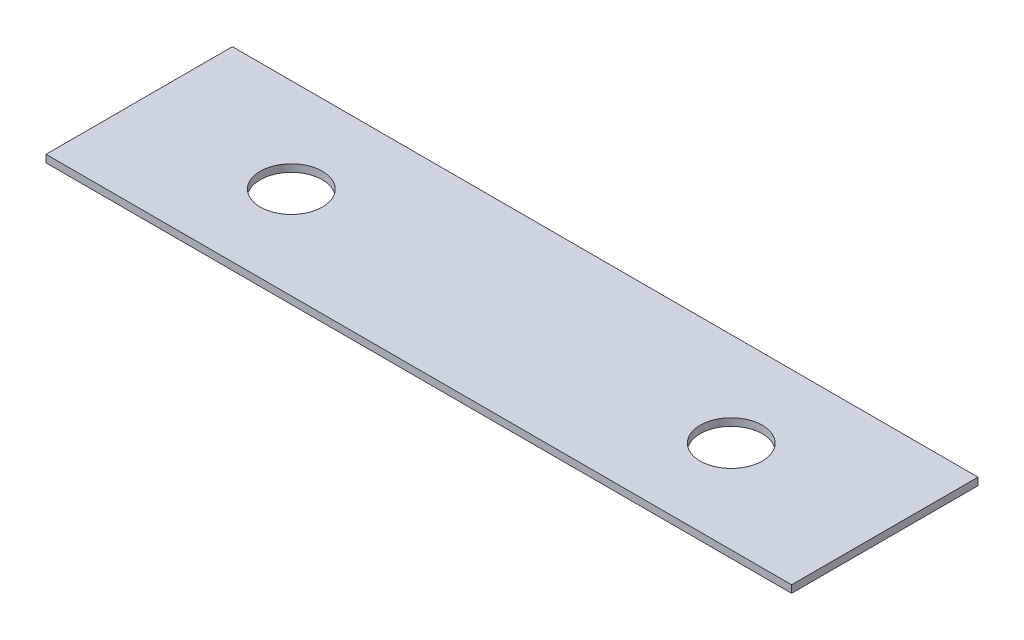
ISO-10303-21;
HEADER;
FILE_DESCRIPTION(('STEP AP214'),'2;1');
FILE_NAME('part.step','',(''),(''),'','','');
FILE_SCHEMA(('AUTOMOTIVE_DESIGN { 1 0 10303 214 1 1 1 1 }'));
ENDSEC;
DATA;
#1=APPLICATION_CONTEXT('core data for automotive mechanical design processes');
#2=APPLICATION_PROTOCOL_DEFINITION('international standard','automotive_design',2000,#1);
#3=PRODUCT_CONTEXT('',#1,'mechanical');
#4=PRODUCT('Part','Part','',(#3));
#5=PRODUCT_RELATED_PRODUCT_CATEGORY('part','',(#4));
#6=PRODUCT_DEFINITION_FORMATION('','',#4);
#7=PRODUCT_DEFINITION_CONTEXT('part definition',#1,'design');
#8=PRODUCT_DEFINITION('design','',#6,#7);
#9=PRODUCT_DEFINITION_SHAPE('','',#8);
#10=(LENGTH_UNIT() NAMED_UNIT(*) SI_UNIT(.MILLI.,.METRE.));
#11=(NAMED_UNIT(*) PLANE_ANGLE_UNIT() SI_UNIT($,.RADIAN.));
#12=(NAMED_UNIT(*) SI_UNIT($,.STERADIAN.) SOLID_ANGLE_UNIT());
#13=UNCERTAINTY_MEASURE_WITH_UNIT(LENGTH_MEASURE(1.E-05),#10,'distance_accuracy_value','');
#14=(GEOMETRIC_REPRESENTATION_CONTEXT(3) GLOBAL_UNCERTAINTY_ASSIGNED_CONTEXT((#13)) GLOBAL_UNIT_ASSIGNED_CONTEXT((#10,
#11,#12)) REPRESENTATION_CONTEXT('',''));
#15=CARTESIAN_POINT('',(0.,0.,0.));
#16=DIRECTION('',(0.,0.,1.));
#17=DIRECTION('',(1.,0.,0.));
#18=AXIS2_PLACEMENT_3D('',#15,#16,#17);
#19=CARTESIAN_POINT('',(152.4,0.,0.));
#20=DIRECTION('',(0.,0.,-1.));
#21=DIRECTION('',(-1.,0.,0.));
#22=AXIS2_PLACEMENT_3D('',#19,#20,#21);
#23=PLANE('',#22);
#24=DIRECTION('',(0.,-1.,0.));
#25=VECTOR('',#24,1.);
#26=CARTESIAN_POINT('',(0.,0.,0.));
#27=LINE('',#26,#25);
#28=CARTESIAN_POINT('',(0.,1.51892,0.));
#29=VERTEX_POINT('',#28);
#30=CARTESIAN_POINT('',(0.,0.,0.));
#31=VERTEX_POINT('',#30);
#32=EDGE_CURVE('E97',#29,#31,#27,.T.);
#33=ORIENTED_EDGE('',*,*,#32,.T.);
#34=DIRECTION('',(-1.,0.,0.));
#35=VECTOR('',#34,1.);
#36=CARTESIAN_POINT('',(152.4,0.,0.));
#37=LINE('',#36,#35);
#38=CARTESIAN_POINT('',(152.4,0.,0.));
#39=VERTEX_POINT('',#38);
#40=EDGE_CURVE('E11',#39,#31,#37,.T.);
#41=ORIENTED_EDGE('',*,*,#40,.F.);
#42=DIRECTION('',(0.,-1.,0.));
#43=VECTOR('',#42,1.);
#44=CARTESIAN_POINT('',(152.4,0.,0.));
#45=LINE('',#44,#43);
#46=CARTESIAN_POINT('',(152.4,1.51892,0.));
#47=VERTEX_POINT('',#46);
#48=EDGE_CURVE('E85',#47,#39,#45,.T.);
#49=ORIENTED_EDGE('',*,*,#48,.F.);
#50=DIRECTION('',(-1.,0.,0.));
#51=VECTOR('',#50,1.);
#52=CARTESIAN_POINT('',(152.4,1.51892,0.));
#53=LINE('',#52,#51);
#54=EDGE_CURVE('E93',#47,#29,#53,.T.);
#55=ORIENTED_EDGE('',*,*,#54,.T.);
#56=EDGE_LOOP('',(#33,#41,#49,#55));
#57=FACE_BOUND('',#56,.T.);
#58=ADVANCED_FACE('F34',(#57),#23,.F.);
#59=CARTESIAN_POINT('',(152.4,0.,0.));
#60=DIRECTION('',(0.,1.,0.));
#61=DIRECTION('',(0.,0.,1.));
#62=AXIS2_PLACEMENT_3D('',#59,#60,#61);
#63=PLANE('',#62);
#64=CARTESIAN_POINT('',(31.242,0.,-18.9));
#65=DIRECTION('',(0.,1.,0.));
#66=DIRECTION('',(0.,0.,1.));
#67=AXIS2_PLACEMENT_3D('',#64,#65,#66);
#68=CIRCLE('',#67,6.35000000000001);
#69=CARTESIAN_POINT('',(31.242,0.,-12.55));
#70=VERTEX_POINT('',#69);
#71=EDGE_CURVE('E100',#70,#70,#68,.F.);
#72=ORIENTED_EDGE('',*,*,#71,.F.);
#73=EDGE_LOOP('',(#72));
#74=FACE_BOUND('',#73,.T.);
#75=CARTESIAN_POINT('',(121.158,0.,-18.9));
#76=DIRECTION('',(0.,1.,0.));
#77=DIRECTION('',(0.,0.,1.));
#78=AXIS2_PLACEMENT_3D('',#75,#76,#77);
#79=CIRCLE('',#78,6.35);
#80=CARTESIAN_POINT('',(121.158,0.,-12.55));
#81=VERTEX_POINT('',#80);
#82=EDGE_CURVE('E111',#81,#81,#79,.F.);
#83=ORIENTED_EDGE('',*,*,#82,.F.);
#84=EDGE_LOOP('',(#83));
#85=FACE_BOUND('',#84,.T.);
#86=DIRECTION('',(0.,0.,-1.));
#87=VECTOR('',#86,1.);
#88=CARTESIAN_POINT('',(0.,0.,0.));
#89=LINE('',#88,#87);
#90=CARTESIAN_POINT('',(0.,0.,-38.1));
#91=VERTEX_POINT('',#90);
#92=EDGE_CURVE('E89',#31,#91,#89,.T.);
#93=ORIENTED_EDGE('',*,*,#92,.T.);
#94=DIRECTION('',(-1.,0.,0.));
#95=VECTOR('',#94,1.);
#96=CARTESIAN_POINT('',(152.4,0.,-38.1));
#97=LINE('',#96,#95);
#98=CARTESIAN_POINT('',(152.4,0.,-38.1));
#99=VERTEX_POINT('',#98);
#100=EDGE_CURVE('E42',#99,#91,#97,.T.);
#101=ORIENTED_EDGE('',*,*,#100,.F.);
#102=DIRECTION('',(0.,0.,-1.));
#103=VECTOR('',#102,1.);
#104=CARTESIAN_POINT('',(152.4,0.,0.));
#105=LINE('',#104,#103);
#106=EDGE_CURVE('E80',#39,#99,#105,.T.);
#107=ORIENTED_EDGE('',*,*,#106,.F.);
#108=ORIENTED_EDGE('',*,*,#40,.T.);
#109=EDGE_LOOP('',(#93,#101,#107,#108));
#110=FACE_BOUND('',#109,.T.);
#111=ADVANCED_FACE('F88',(#74,#85,#110),#63,.F.);
#112=CARTESIAN_POINT('',(152.4,0.,-38.1));
#113=DIRECTION('',(0.,0.,1.));
#114=DIRECTION('',(1.,0.,0.));
#115=AXIS2_PLACEMENT_3D('',#112,#113,#114);
#116=PLANE('',#115);
#117=DIRECTION('',(0.,1.,0.));
#118=VECTOR('',#117,1.);
#119=CARTESIAN_POINT('',(0.,0.,-38.1));
#120=LINE('',#119,#118);
#121=CARTESIAN_POINT('',(0.,1.51892,-38.1));
#122=VERTEX_POINT('',#121);
#123=EDGE_CURVE('E67',#91,#122,#120,.T.);
#124=ORIENTED_EDGE('',*,*,#123,.T.);
#125=DIRECTION('',(-1.,0.,0.));
#126=VECTOR('',#125,1.);
#127=CARTESIAN_POINT('',(152.4,1.51892,-38.1));
#128=LINE('',#127,#126);
#129=CARTESIAN_POINT('',(152.4,1.51892,-38.1));
#130=VERTEX_POINT('',#129);
#131=EDGE_CURVE('E90',#130,#122,#128,.T.);
#132=ORIENTED_EDGE('',*,*,#131,.F.);
#133=DIRECTION('',(0.,1.,0.));
#134=VECTOR('',#133,1.);
#135=CARTESIAN_POINT('',(152.4,0.,-38.1));
#136=LINE('',#135,#134);
#137=EDGE_CURVE('E83',#99,#130,#136,.T.);
#138=ORIENTED_EDGE('',*,*,#137,.F.);
#139=ORIENTED_EDGE('',*,*,#100,.T.);
#140=EDGE_LOOP('',(#124,#132,#138,#139));
#141=FACE_BOUND('',#140,.T.);
#142=ADVANCED_FACE('F91',(#141),#116,.F.);
#143=CARTESIAN_POINT('',(152.4,1.51892,0.));
#144=DIRECTION('',(0.,-1.,0.));
#145=DIRECTION('',(0.,0.,-1.));
#146=AXIS2_PLACEMENT_3D('',#143,#144,#145);
#147=PLANE('',#146);
#148=CARTESIAN_POINT('',(31.242,1.51892,-18.9));
#149=DIRECTION('',(0.,1.,0.));
#150=DIRECTION('',(0.,0.,1.));
#151=AXIS2_PLACEMENT_3D('',#148,#149,#150);
#152=CIRCLE('',#151,6.35000000000001);
#153=CARTESIAN_POINT('',(31.242,1.51892,-12.55));
#154=VERTEX_POINT('',#153);
#155=EDGE_CURVE('E114',#154,#154,#152,.T.);
#156=ORIENTED_EDGE('',*,*,#155,.F.);
#157=EDGE_LOOP('',(#156));
#158=FACE_BOUND('',#157,.T.);
#159=CARTESIAN_POINT('',(121.158,1.51892,-18.9));
#160=DIRECTION('',(0.,1.,0.));
#161=DIRECTION('',(0.,0.,1.));
#162=AXIS2_PLACEMENT_3D('',#159,#160,#161);
#163=CIRCLE('',#162,6.35);
#164=CARTESIAN_POINT('',(121.158,1.51892,-12.55));
#165=VERTEX_POINT('',#164);
#166=EDGE_CURVE('E115',#165,#165,#163,.T.);
#167=ORIENTED_EDGE('',*,*,#166,.F.);
#168=EDGE_LOOP('',(#167));
#169=FACE_BOUND('',#168,.T.);
#170=DIRECTION('',(0.,0.,1.));
#171=VECTOR('',#170,1.);
#172=CARTESIAN_POINT('',(0.,1.51892,0.));
#173=LINE('',#172,#171);
#174=EDGE_CURVE('E73',#122,#29,#173,.T.);
#175=ORIENTED_EDGE('',*,*,#174,.T.);
#176=ORIENTED_EDGE('',*,*,#54,.F.);
#177=DIRECTION('',(0.,0.,1.));
#178=VECTOR('',#177,1.);
#179=CARTESIAN_POINT('',(152.4,1.51892,0.));
#180=LINE('',#179,#178);
#181=EDGE_CURVE('E50',#130,#47,#180,.T.);
#182=ORIENTED_EDGE('',*,*,#181,.F.);
#183=ORIENTED_EDGE('',*,*,#131,.T.);
#184=EDGE_LOOP('',(#175,#176,#182,#183));
#185=FACE_BOUND('',#184,.T.);
#186=ADVANCED_FACE('F105',(#158,#169,#185),#147,.F.);
#187=CARTESIAN_POINT('',(152.4,0.,0.));
#188=DIRECTION('',(-1.,0.,0.));
#189=DIRECTION('',(0.,0.,1.));
#190=AXIS2_PLACEMENT_3D('',#187,#188,#189);
#191=PLANE('',#190);
#192=ORIENTED_EDGE('',*,*,#48,.T.);
#193=ORIENTED_EDGE('',*,*,#106,.T.);
#194=ORIENTED_EDGE('',*,*,#137,.T.);
#195=ORIENTED_EDGE('',*,*,#181,.T.);
#196=EDGE_LOOP('',(#192,#193,#194,#195));
#197=FACE_BOUND('',#196,.T.);
#198=ADVANCED_FACE('F81',(#197),#191,.F.);
#199=CARTESIAN_POINT('',(0.,0.,0.));
#200=DIRECTION('',(-1.,0.,0.));
#201=DIRECTION('',(0.,0.,1.));
#202=AXIS2_PLACEMENT_3D('',#199,#200,#201);
#203=PLANE('',#202);
#204=ORIENTED_EDGE('',*,*,#32,.F.);
#205=ORIENTED_EDGE('',*,*,#174,.F.);
#206=ORIENTED_EDGE('',*,*,#123,.F.);
#207=ORIENTED_EDGE('',*,*,#92,.F.);
#208=EDGE_LOOP('',(#204,#205,#206,#207));
#209=FACE_BOUND('',#208,.T.);
#210=ADVANCED_FACE('F108',(#209),#203,.T.);
#211=CARTESIAN_POINT('',(121.158,-0.000999999999999916,-18.9));
#212=DIRECTION('',(0.,1.,0.));
#213=DIRECTION('',(0.,0.,1.));
#214=AXIS2_PLACEMENT_3D('',#211,#212,#213);
#215=CYLINDRICAL_SURFACE('',#214,6.35);
#216=ORIENTED_EDGE('',*,*,#166,.T.);
#217=EDGE_LOOP('',(#216));
#218=FACE_BOUND('',#217,.T.);
#219=ORIENTED_EDGE('',*,*,#82,.T.);
#220=EDGE_LOOP('',(#219));
#221=FACE_BOUND('',#220,.T.);
#222=ADVANCED_FACE('F131',(#218,#221),#215,.F.);
#223=CARTESIAN_POINT('',(31.242,-0.000999999999999916,-18.9));
#224=DIRECTION('',(0.,1.,0.));
#225=DIRECTION('',(0.,0.,1.));
#226=AXIS2_PLACEMENT_3D('',#223,#224,#225);
#227=CYLINDRICAL_SURFACE('',#226,6.35000000000001);
#228=ORIENTED_EDGE('',*,*,#155,.T.);
#229=EDGE_LOOP('',(#228));
#230=FACE_BOUND('',#229,.T.);
#231=ORIENTED_EDGE('',*,*,#71,.T.);
#232=EDGE_LOOP('',(#231));
#233=FACE_BOUND('',#232,.T.);
#234=ADVANCED_FACE('F123',(#230,#233),#227,.F.);
#235=CLOSED_SHELL('',(#58,#111,#142,#186,#198,#210,#222,#234));
#236=MANIFOLD_SOLID_BREP('B2',#235);
#237=ADVANCED_BREP_SHAPE_REPRESENTATION('',(#18,#236),#14);
#238=SHAPE_DEFINITION_REPRESENTATION(#9,#237);
ENDSEC;
END-ISO-10303-21;
